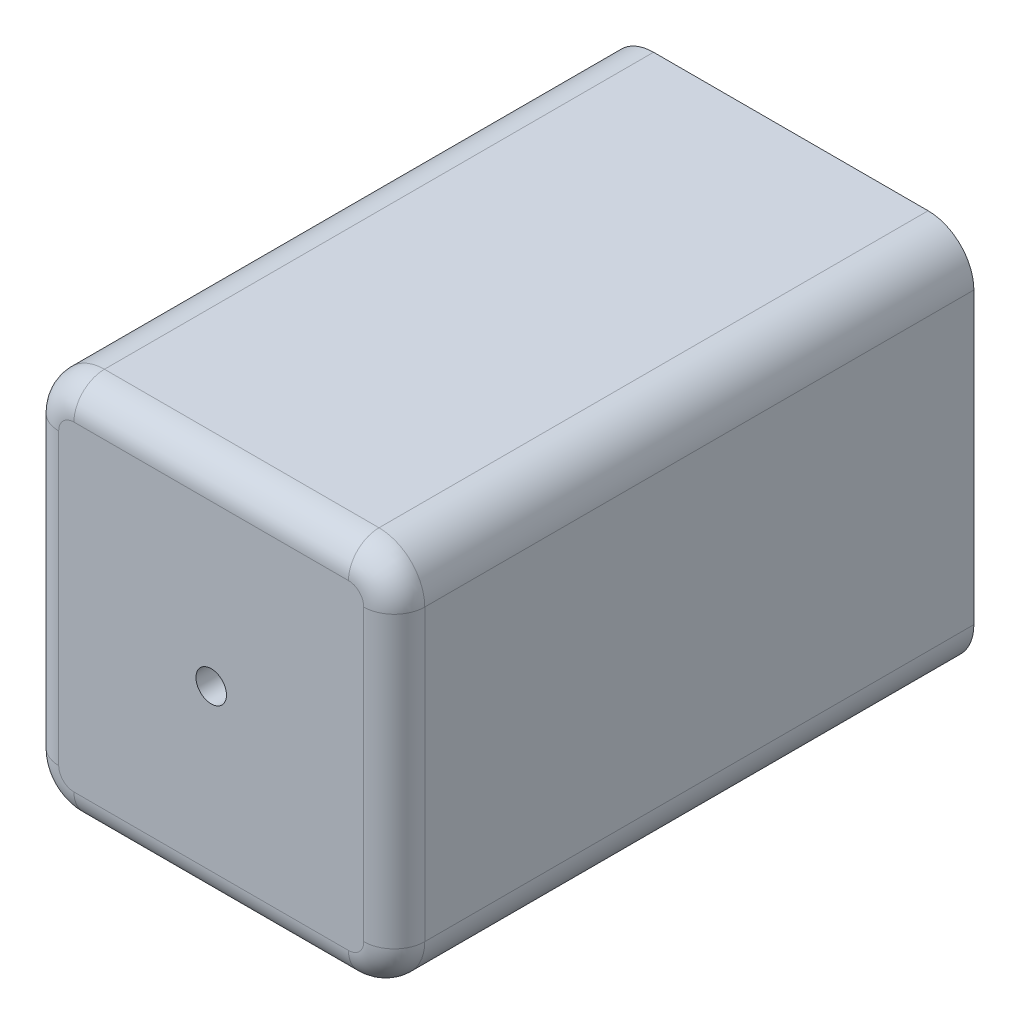
ISO-10303-21;
HEADER;
FILE_DESCRIPTION(('STEP AP214'),'2;1');
FILE_NAME('part.step','',(''),(''),'','','');
FILE_SCHEMA(('AUTOMOTIVE_DESIGN { 1 0 10303 214 1 1 1 1 }'));
ENDSEC;
DATA;
#1=APPLICATION_CONTEXT('core data for automotive mechanical design processes');
#2=APPLICATION_PROTOCOL_DEFINITION('international standard','automotive_design',2000,#1);
#3=PRODUCT_CONTEXT('',#1,'mechanical');
#4=PRODUCT('Part','Part','',(#3));
#5=PRODUCT_RELATED_PRODUCT_CATEGORY('part','',(#4));
#6=PRODUCT_DEFINITION_FORMATION('','',#4);
#7=PRODUCT_DEFINITION_CONTEXT('part definition',#1,'design');
#8=PRODUCT_DEFINITION('design','',#6,#7);
#9=PRODUCT_DEFINITION_SHAPE('','',#8);
#10=(LENGTH_UNIT() NAMED_UNIT(*) SI_UNIT(.MILLI.,.METRE.));
#11=(NAMED_UNIT(*) PLANE_ANGLE_UNIT() SI_UNIT($,.RADIAN.));
#12=(NAMED_UNIT(*) SI_UNIT($,.STERADIAN.) SOLID_ANGLE_UNIT());
#13=UNCERTAINTY_MEASURE_WITH_UNIT(LENGTH_MEASURE(1.E-05),#10,'distance_accuracy_value','');
#14=(GEOMETRIC_REPRESENTATION_CONTEXT(3) GLOBAL_UNCERTAINTY_ASSIGNED_CONTEXT((#13)) GLOBAL_UNIT_ASSIGNED_CONTEXT((#10,
#11,#12)) REPRESENTATION_CONTEXT('',''));
#15=CARTESIAN_POINT('',(0.,0.,0.));
#16=DIRECTION('',(0.,0.,1.));
#17=DIRECTION('',(1.,0.,0.));
#18=AXIS2_PLACEMENT_3D('',#15,#16,#17);
#19=CARTESIAN_POINT('',(120.,-62.5,-95.));
#20=DIRECTION('',(0.,0.,1.));
#21=DIRECTION('',(1.,0.,0.));
#22=AXIS2_PLACEMENT_3D('',#19,#20,#21);
#23=PLANE('',#22);
#24=CARTESIAN_POINT('',(60.,0.,-95.));
#25=DIRECTION('',(0.,0.,-1.));
#26=DIRECTION('',(-1.,0.,0.));
#27=AXIS2_PLACEMENT_3D('',#24,#25,#26);
#28=CIRCLE('',#27,5.);
#29=CARTESIAN_POINT('',(55.,0.,-95.));
#30=VERTEX_POINT('',#29);
#31=EDGE_CURVE('E154',#30,#30,#28,.T.);
#32=ORIENTED_EDGE('',*,*,#31,.F.);
#33=EDGE_LOOP('',(#32));
#34=FACE_BOUND('',#33,.T.);
#35=DIRECTION('',(-1.,0.,0.));
#36=VECTOR('',#35,1.);
#37=CARTESIAN_POINT('',(120.,62.5,-95.));
#38=LINE('',#37,#36);
#39=CARTESIAN_POINT('',(105.,62.5,-95.));
#40=VERTEX_POINT('',#39);
#41=CARTESIAN_POINT('',(15.,62.5,-95.));
#42=VERTEX_POINT('',#41);
#43=EDGE_CURVE('E134',#40,#42,#38,.T.);
#44=ORIENTED_EDGE('',*,*,#43,.F.);
#45=CARTESIAN_POINT('',(105.,47.5,-95.));
#46=DIRECTION('',(0.,0.,1.));
#47=DIRECTION('',(1.,0.,0.));
#48=AXIS2_PLACEMENT_3D('',#45,#46,#47);
#49=CIRCLE('',#48,15.);
#50=CARTESIAN_POINT('',(120.,47.5,-95.));
#51=VERTEX_POINT('',#50);
#52=EDGE_CURVE('E142',#40,#51,#49,.F.);
#53=ORIENTED_EDGE('',*,*,#52,.T.);
#54=DIRECTION('',(0.,1.,0.));
#55=VECTOR('',#54,1.);
#56=CARTESIAN_POINT('',(120.,-62.5,-95.));
#57=LINE('',#56,#55);
#58=CARTESIAN_POINT('',(120.,-47.5,-95.));
#59=VERTEX_POINT('',#58);
#60=EDGE_CURVE('E130',#59,#51,#57,.T.);
#61=ORIENTED_EDGE('',*,*,#60,.F.);
#62=CARTESIAN_POINT('',(105.,-47.5,-95.));
#63=DIRECTION('',(0.,0.,1.));
#64=DIRECTION('',(1.,0.,0.));
#65=AXIS2_PLACEMENT_3D('',#62,#63,#64);
#66=CIRCLE('',#65,15.);
#67=CARTESIAN_POINT('',(105.,-62.5,-95.));
#68=VERTEX_POINT('',#67);
#69=EDGE_CURVE('E136',#59,#68,#66,.F.);
#70=ORIENTED_EDGE('',*,*,#69,.T.);
#71=DIRECTION('',(-1.,0.,0.));
#72=VECTOR('',#71,1.);
#73=CARTESIAN_POINT('',(120.,-62.5,-95.));
#74=LINE('',#73,#72);
#75=CARTESIAN_POINT('',(15.,-62.5,-95.));
#76=VERTEX_POINT('',#75);
#77=EDGE_CURVE('E147',#68,#76,#74,.T.);
#78=ORIENTED_EDGE('',*,*,#77,.T.);
#79=CARTESIAN_POINT('',(15.,-47.5,-95.));
#80=DIRECTION('',(0.,0.,1.));
#81=DIRECTION('',(1.,0.,0.));
#82=AXIS2_PLACEMENT_3D('',#79,#80,#81);
#83=CIRCLE('',#82,15.);
#84=CARTESIAN_POINT('',(0.,-47.5,-95.));
#85=VERTEX_POINT('',#84);
#86=EDGE_CURVE('E165',#76,#85,#83,.F.);
#87=ORIENTED_EDGE('',*,*,#86,.T.);
#88=DIRECTION('',(0.,1.,0.));
#89=VECTOR('',#88,1.);
#90=CARTESIAN_POINT('',(0.,-62.5,-95.));
#91=LINE('',#90,#89);
#92=CARTESIAN_POINT('',(0.,47.5,-95.));
#93=VERTEX_POINT('',#92);
#94=EDGE_CURVE('E148',#85,#93,#91,.T.);
#95=ORIENTED_EDGE('',*,*,#94,.T.);
#96=CARTESIAN_POINT('',(15.,47.5,-95.));
#97=DIRECTION('',(0.,0.,1.));
#98=DIRECTION('',(1.,0.,0.));
#99=AXIS2_PLACEMENT_3D('',#96,#97,#98);
#100=CIRCLE('',#99,15.);
#101=EDGE_CURVE('E143',#93,#42,#100,.F.);
#102=ORIENTED_EDGE('',*,*,#101,.T.);
#103=EDGE_LOOP('',(#44,#53,#61,#70,#78,#87,#95,#102));
#104=FACE_BOUND('',#103,.T.);
#105=ADVANCED_FACE('F37',(#34,#104),#23,.F.);
#106=CARTESIAN_POINT('',(120.,62.5,95.));
#107=DIRECTION('',(0.,-1.,0.));
#108=DIRECTION('',(0.,0.,-1.));
#109=AXIS2_PLACEMENT_3D('',#106,#107,#108);
#110=PLANE('',#109);
#111=DIRECTION('',(0.,0.,1.));
#112=VECTOR('',#111,1.);
#113=CARTESIAN_POINT('',(15.,62.5,95.));
#114=LINE('',#113,#112);
#115=CARTESIAN_POINT('',(15.,62.5,85.));
#116=VERTEX_POINT('',#115);
#117=EDGE_CURVE('E160',#42,#116,#114,.T.);
#118=ORIENTED_EDGE('',*,*,#117,.T.);
#119=DIRECTION('',(-1.,0.,0.));
#120=VECTOR('',#119,1.);
#121=CARTESIAN_POINT('',(120.,62.5,85.));
#122=LINE('',#121,#120);
#123=CARTESIAN_POINT('',(105.,62.5,85.));
#124=VERTEX_POINT('',#123);
#125=EDGE_CURVE('E46',#116,#124,#122,.F.);
#126=ORIENTED_EDGE('',*,*,#125,.T.);
#127=DIRECTION('',(0.,0.,1.));
#128=VECTOR('',#127,1.);
#129=CARTESIAN_POINT('',(105.,62.5,95.));
#130=LINE('',#129,#128);
#131=EDGE_CURVE('E163',#124,#40,#130,.F.);
#132=ORIENTED_EDGE('',*,*,#131,.T.);
#133=ORIENTED_EDGE('',*,*,#43,.T.);
#134=EDGE_LOOP('',(#118,#126,#132,#133));
#135=FACE_BOUND('',#134,.T.);
#136=ADVANCED_FACE('F242',(#135),#110,.F.);
#137=CARTESIAN_POINT('',(120.,-62.5,95.));
#138=DIRECTION('',(0.,0.,-1.));
#139=DIRECTION('',(-1.,0.,0.));
#140=AXIS2_PLACEMENT_3D('',#137,#138,#139);
#141=PLANE('',#140);
#142=CARTESIAN_POINT('',(60.,0.,95.));
#143=DIRECTION('',(0.,0.,-1.));
#144=DIRECTION('',(-1.,0.,0.));
#145=AXIS2_PLACEMENT_3D('',#142,#143,#144);
#146=CIRCLE('',#145,5.);
#147=CARTESIAN_POINT('',(55.,0.,95.));
#148=VERTEX_POINT('',#147);
#149=EDGE_CURVE('E210',#148,#148,#146,.T.);
#150=ORIENTED_EDGE('',*,*,#149,.T.);
#151=EDGE_LOOP('',(#150));
#152=FACE_BOUND('',#151,.T.);
#153=CARTESIAN_POINT('',(15.,47.5,95.));
#154=DIRECTION('',(0.,0.,-1.));
#155=DIRECTION('',(-1.,0.,0.));
#156=AXIS2_PLACEMENT_3D('',#153,#154,#155);
#157=CIRCLE('',#156,5.);
#158=CARTESIAN_POINT('',(15.,52.5,95.));
#159=VERTEX_POINT('',#158);
#160=CARTESIAN_POINT('',(10.,47.5,95.));
#161=VERTEX_POINT('',#160);
#162=EDGE_CURVE('E187',#159,#161,#157,.F.);
#163=ORIENTED_EDGE('',*,*,#162,.T.);
#164=DIRECTION('',(0.,-1.,0.));
#165=VECTOR('',#164,1.);
#166=CARTESIAN_POINT('',(9.99999999999999,-47.5,95.));
#167=LINE('',#166,#165);
#168=CARTESIAN_POINT('',(10.,-47.5,95.));
#169=VERTEX_POINT('',#168);
#170=EDGE_CURVE('E192',#161,#169,#167,.T.);
#171=ORIENTED_EDGE('',*,*,#170,.T.);
#172=CARTESIAN_POINT('',(15.,-47.5,95.));
#173=DIRECTION('',(0.,0.,-1.));
#174=DIRECTION('',(-1.,0.,0.));
#175=AXIS2_PLACEMENT_3D('',#172,#173,#174);
#176=CIRCLE('',#175,5.);
#177=CARTESIAN_POINT('',(15.,-52.5,95.));
#178=VERTEX_POINT('',#177);
#179=EDGE_CURVE('E189',#169,#178,#176,.F.);
#180=ORIENTED_EDGE('',*,*,#179,.T.);
#181=DIRECTION('',(-1.,0.,0.));
#182=VECTOR('',#181,1.);
#183=CARTESIAN_POINT('',(120.,-52.5,95.));
#184=LINE('',#183,#182);
#185=CARTESIAN_POINT('',(105.,-52.5,95.));
#186=VERTEX_POINT('',#185);
#187=EDGE_CURVE('E185',#178,#186,#184,.F.);
#188=ORIENTED_EDGE('',*,*,#187,.T.);
#189=CARTESIAN_POINT('',(105.,-47.5,95.));
#190=DIRECTION('',(0.,0.,-1.));
#191=DIRECTION('',(-1.,0.,0.));
#192=AXIS2_PLACEMENT_3D('',#189,#190,#191);
#193=CIRCLE('',#192,5.);
#194=CARTESIAN_POINT('',(110.,-47.5,95.));
#195=VERTEX_POINT('',#194);
#196=EDGE_CURVE('E179',#186,#195,#193,.F.);
#197=ORIENTED_EDGE('',*,*,#196,.T.);
#198=DIRECTION('',(0.,-1.,0.));
#199=VECTOR('',#198,1.);
#200=CARTESIAN_POINT('',(110.,-62.5,95.));
#201=LINE('',#200,#199);
#202=CARTESIAN_POINT('',(110.,47.5,95.));
#203=VERTEX_POINT('',#202);
#204=EDGE_CURVE('E177',#195,#203,#201,.F.);
#205=ORIENTED_EDGE('',*,*,#204,.T.);
#206=CARTESIAN_POINT('',(105.,47.5,95.));
#207=DIRECTION('',(0.,0.,-1.));
#208=DIRECTION('',(-1.,0.,0.));
#209=AXIS2_PLACEMENT_3D('',#206,#207,#208);
#210=CIRCLE('',#209,5.);
#211=CARTESIAN_POINT('',(105.,52.5,95.));
#212=VERTEX_POINT('',#211);
#213=EDGE_CURVE('E181',#203,#212,#210,.F.);
#214=ORIENTED_EDGE('',*,*,#213,.T.);
#215=DIRECTION('',(-1.,0.,0.));
#216=VECTOR('',#215,1.);
#217=CARTESIAN_POINT('',(120.,52.5,95.));
#218=LINE('',#217,#216);
#219=EDGE_CURVE('E183',#212,#159,#218,.T.);
#220=ORIENTED_EDGE('',*,*,#219,.T.);
#221=EDGE_LOOP('',(#163,#171,#180,#188,#197,#205,#214,#220));
#222=FACE_BOUND('',#221,.T.);
#223=ADVANCED_FACE('F261',(#152,#222),#141,.F.);
#224=CARTESIAN_POINT('',(120.,-62.5,95.));
#225=DIRECTION('',(0.,1.,0.));
#226=DIRECTION('',(0.,0.,1.));
#227=AXIS2_PLACEMENT_3D('',#224,#225,#226);
#228=PLANE('',#227);
#229=DIRECTION('',(0.,0.,-1.));
#230=VECTOR('',#229,1.);
#231=CARTESIAN_POINT('',(105.,-62.5,95.));
#232=LINE('',#231,#230);
#233=CARTESIAN_POINT('',(105.,-62.5,85.));
#234=VERTEX_POINT('',#233);
#235=EDGE_CURVE('E138',#68,#234,#232,.F.);
#236=ORIENTED_EDGE('',*,*,#235,.T.);
#237=DIRECTION('',(-1.,0.,0.));
#238=VECTOR('',#237,1.);
#239=CARTESIAN_POINT('',(120.,-62.5,85.));
#240=LINE('',#239,#238);
#241=CARTESIAN_POINT('',(15.,-62.5,85.));
#242=VERTEX_POINT('',#241);
#243=EDGE_CURVE('E202',#234,#242,#240,.T.);
#244=ORIENTED_EDGE('',*,*,#243,.T.);
#245=DIRECTION('',(0.,0.,-1.));
#246=VECTOR('',#245,1.);
#247=CARTESIAN_POINT('',(15.,-62.5,-95.));
#248=LINE('',#247,#246);
#249=EDGE_CURVE('E169',#242,#76,#248,.T.);
#250=ORIENTED_EDGE('',*,*,#249,.T.);
#251=ORIENTED_EDGE('',*,*,#77,.F.);
#252=EDGE_LOOP('',(#236,#244,#250,#251));
#253=FACE_BOUND('',#252,.T.);
#254=ADVANCED_FACE('F274',(#253),#228,.F.);
#255=CARTESIAN_POINT('',(120.,0.,0.));
#256=DIRECTION('',(-1.,0.,0.));
#257=DIRECTION('',(0.,0.,1.));
#258=AXIS2_PLACEMENT_3D('',#255,#256,#257);
#259=PLANE('',#258);
#260=DIRECTION('',(0.,0.,1.));
#261=VECTOR('',#260,1.);
#262=CARTESIAN_POINT('',(120.,47.5,0.));
#263=LINE('',#262,#261);
#264=CARTESIAN_POINT('',(120.,47.5,85.));
#265=VERTEX_POINT('',#264);
#266=EDGE_CURVE('E133',#51,#265,#263,.T.);
#267=ORIENTED_EDGE('',*,*,#266,.T.);
#268=DIRECTION('',(0.,-1.,0.));
#269=VECTOR('',#268,1.);
#270=CARTESIAN_POINT('',(120.,0.,85.));
#271=LINE('',#270,#269);
#272=CARTESIAN_POINT('',(120.,-47.5,85.));
#273=VERTEX_POINT('',#272);
#274=EDGE_CURVE('E11',#265,#273,#271,.T.);
#275=ORIENTED_EDGE('',*,*,#274,.T.);
#276=DIRECTION('',(0.,0.,-1.));
#277=VECTOR('',#276,1.);
#278=CARTESIAN_POINT('',(120.,-47.5,0.));
#279=LINE('',#278,#277);
#280=EDGE_CURVE('E126',#273,#59,#279,.T.);
#281=ORIENTED_EDGE('',*,*,#280,.T.);
#282=ORIENTED_EDGE('',*,*,#60,.T.);
#283=EDGE_LOOP('',(#267,#275,#281,#282));
#284=FACE_BOUND('',#283,.T.);
#285=ADVANCED_FACE('F128',(#284),#259,.F.);
#286=CARTESIAN_POINT('',(0.,0.,0.));
#287=DIRECTION('',(-1.,0.,0.));
#288=DIRECTION('',(0.,0.,1.));
#289=AXIS2_PLACEMENT_3D('',#286,#287,#288);
#290=PLANE('',#289);
#291=DIRECTION('',(0.,0.,-1.));
#292=VECTOR('',#291,1.);
#293=CARTESIAN_POINT('',(0.,-47.5,95.));
#294=LINE('',#293,#292);
#295=CARTESIAN_POINT('',(0.,-47.5,85.));
#296=VERTEX_POINT('',#295);
#297=EDGE_CURVE('E172',#85,#296,#294,.F.);
#298=ORIENTED_EDGE('',*,*,#297,.T.);
#299=DIRECTION('',(0.,-1.,0.));
#300=VECTOR('',#299,1.);
#301=CARTESIAN_POINT('',(0.,47.5,85.));
#302=LINE('',#301,#300);
#303=CARTESIAN_POINT('',(0.,47.5,85.));
#304=VERTEX_POINT('',#303);
#305=EDGE_CURVE('E204',#296,#304,#302,.F.);
#306=ORIENTED_EDGE('',*,*,#305,.T.);
#307=DIRECTION('',(0.,0.,1.));
#308=VECTOR('',#307,1.);
#309=CARTESIAN_POINT('',(0.,47.5,-95.));
#310=LINE('',#309,#308);
#311=EDGE_CURVE('E175',#304,#93,#310,.F.);
#312=ORIENTED_EDGE('',*,*,#311,.T.);
#313=ORIENTED_EDGE('',*,*,#94,.F.);
#314=EDGE_LOOP('',(#298,#306,#312,#313));
#315=FACE_BOUND('',#314,.T.);
#316=ADVANCED_FACE('F305',(#315),#290,.T.);
#317=CARTESIAN_POINT('',(105.,47.5,0.));
#318=DIRECTION('',(0.,0.,1.));
#319=DIRECTION('',(1.,0.,0.));
#320=AXIS2_PLACEMENT_3D('',#317,#318,#319);
#321=CYLINDRICAL_SURFACE('',#320,15.);
#322=ORIENTED_EDGE('',*,*,#131,.F.);
#323=CARTESIAN_POINT('',(105.,47.5,85.));
#324=DIRECTION('',(0.,0.,-1.));
#325=DIRECTION('',(-1.,0.,0.));
#326=AXIS2_PLACEMENT_3D('',#323,#324,#325);
#327=CIRCLE('',#326,15.);
#328=EDGE_CURVE('E199',#124,#265,#327,.T.);
#329=ORIENTED_EDGE('',*,*,#328,.T.);
#330=ORIENTED_EDGE('',*,*,#266,.F.);
#331=ORIENTED_EDGE('',*,*,#52,.F.);
#332=EDGE_LOOP('',(#322,#329,#330,#331));
#333=FACE_BOUND('',#332,.T.);
#334=ADVANCED_FACE('F240',(#333),#321,.T.);
#335=CARTESIAN_POINT('',(105.,-47.5,0.));
#336=DIRECTION('',(0.,0.,-1.));
#337=DIRECTION('',(-1.,0.,0.));
#338=AXIS2_PLACEMENT_3D('',#335,#336,#337);
#339=CYLINDRICAL_SURFACE('',#338,15.);
#340=ORIENTED_EDGE('',*,*,#280,.F.);
#341=CARTESIAN_POINT('',(105.,-47.5,85.));
#342=DIRECTION('',(0.,0.,-1.));
#343=DIRECTION('',(-1.,0.,0.));
#344=AXIS2_PLACEMENT_3D('',#341,#342,#343);
#345=CIRCLE('',#344,15.);
#346=EDGE_CURVE('E59',#273,#234,#345,.T.);
#347=ORIENTED_EDGE('',*,*,#346,.T.);
#348=ORIENTED_EDGE('',*,*,#235,.F.);
#349=ORIENTED_EDGE('',*,*,#69,.F.);
#350=EDGE_LOOP('',(#340,#347,#348,#349));
#351=FACE_BOUND('',#350,.T.);
#352=ADVANCED_FACE('F137',(#351),#339,.T.);
#353=CARTESIAN_POINT('',(15.,47.5,95.));
#354=DIRECTION('',(0.,0.,-1.));
#355=DIRECTION('',(-1.,0.,0.));
#356=AXIS2_PLACEMENT_3D('',#353,#354,#355);
#357=CYLINDRICAL_SURFACE('',#356,15.);
#358=ORIENTED_EDGE('',*,*,#311,.F.);
#359=CARTESIAN_POINT('',(15.,47.5,85.));
#360=DIRECTION('',(0.,0.,-1.));
#361=DIRECTION('',(-1.,0.,0.));
#362=AXIS2_PLACEMENT_3D('',#359,#360,#361);
#363=CIRCLE('',#362,15.);
#364=EDGE_CURVE('E197',#304,#116,#363,.T.);
#365=ORIENTED_EDGE('',*,*,#364,.T.);
#366=ORIENTED_EDGE('',*,*,#117,.F.);
#367=ORIENTED_EDGE('',*,*,#101,.F.);
#368=EDGE_LOOP('',(#358,#365,#366,#367));
#369=FACE_BOUND('',#368,.T.);
#370=ADVANCED_FACE('F248',(#369),#357,.T.);
#371=CARTESIAN_POINT('',(15.,-47.5,95.));
#372=DIRECTION('',(0.,0.,1.));
#373=DIRECTION('',(1.,0.,0.));
#374=AXIS2_PLACEMENT_3D('',#371,#372,#373);
#375=CYLINDRICAL_SURFACE('',#374,15.);
#376=ORIENTED_EDGE('',*,*,#249,.F.);
#377=CARTESIAN_POINT('',(15.,-47.5,85.));
#378=DIRECTION('',(0.,0.,-1.));
#379=DIRECTION('',(-1.,0.,0.));
#380=AXIS2_PLACEMENT_3D('',#377,#378,#379);
#381=CIRCLE('',#380,15.);
#382=EDGE_CURVE('E194',#242,#296,#381,.T.);
#383=ORIENTED_EDGE('',*,*,#382,.T.);
#384=ORIENTED_EDGE('',*,*,#297,.F.);
#385=ORIENTED_EDGE('',*,*,#86,.F.);
#386=EDGE_LOOP('',(#376,#383,#384,#385));
#387=FACE_BOUND('',#386,.T.);
#388=ADVANCED_FACE('F278',(#387),#375,.T.);
#389=CARTESIAN_POINT('',(105.,47.5,85.));
#390=DIRECTION('',(0.,0.,-1.));
#391=DIRECTION('',(-1.,0.,0.));
#392=AXIS2_PLACEMENT_3D('',#389,#390,#391);
#393=DEGENERATE_TOROIDAL_SURFACE('',#392,5.,10.,.T.);
#394=CARTESIAN_POINT('',(110.,47.5,85.));
#395=DIRECTION('',(0.,-1.,0.));
#396=DIRECTION('',(0.,0.,-1.));
#397=AXIS2_PLACEMENT_3D('',#394,#395,#396);
#398=CIRCLE('',#397,10.);
#399=EDGE_CURVE('E223',#265,#203,#398,.T.);
#400=ORIENTED_EDGE('',*,*,#399,.F.);
#401=ORIENTED_EDGE('',*,*,#328,.F.);
#402=CARTESIAN_POINT('',(105.,52.5,85.));
#403=DIRECTION('',(-1.,0.,0.));
#404=DIRECTION('',(0.,0.,1.));
#405=AXIS2_PLACEMENT_3D('',#402,#403,#404);
#406=CIRCLE('',#405,10.);
#407=EDGE_CURVE('E41',#212,#124,#406,.T.);
#408=ORIENTED_EDGE('',*,*,#407,.F.);
#409=ORIENTED_EDGE('',*,*,#213,.F.);
#410=EDGE_LOOP('',(#400,#401,#408,#409));
#411=FACE_BOUND('',#410,.T.);
#412=ADVANCED_FACE('F39',(#411),#393,.T.);
#413=CARTESIAN_POINT('',(120.,52.5,85.));
#414=DIRECTION('',(-1.,0.,0.));
#415=DIRECTION('',(0.,0.,1.));
#416=AXIS2_PLACEMENT_3D('',#413,#414,#415);
#417=CYLINDRICAL_SURFACE('',#416,10.);
#418=ORIENTED_EDGE('',*,*,#407,.T.);
#419=ORIENTED_EDGE('',*,*,#125,.F.);
#420=CARTESIAN_POINT('',(15.,52.5,85.));
#421=DIRECTION('',(-1.,0.,0.));
#422=DIRECTION('',(0.,0.,1.));
#423=AXIS2_PLACEMENT_3D('',#420,#421,#422);
#424=CIRCLE('',#423,10.);
#425=EDGE_CURVE('E221',#159,#116,#424,.T.);
#426=ORIENTED_EDGE('',*,*,#425,.F.);
#427=ORIENTED_EDGE('',*,*,#219,.F.);
#428=EDGE_LOOP('',(#418,#419,#426,#427));
#429=FACE_BOUND('',#428,.T.);
#430=ADVANCED_FACE('F233',(#429),#417,.T.);
#431=CARTESIAN_POINT('',(110.,0.,85.));
#432=DIRECTION('',(0.,-1.,0.));
#433=DIRECTION('',(0.,0.,-1.));
#434=AXIS2_PLACEMENT_3D('',#431,#432,#433);
#435=CYLINDRICAL_SURFACE('',#434,10.);
#436=ORIENTED_EDGE('',*,*,#399,.T.);
#437=ORIENTED_EDGE('',*,*,#204,.F.);
#438=CARTESIAN_POINT('',(110.,-47.5,85.));
#439=DIRECTION('',(0.,-1.,0.));
#440=DIRECTION('',(0.,0.,-1.));
#441=AXIS2_PLACEMENT_3D('',#438,#439,#440);
#442=CIRCLE('',#441,10.);
#443=EDGE_CURVE('E218',#273,#195,#442,.T.);
#444=ORIENTED_EDGE('',*,*,#443,.F.);
#445=ORIENTED_EDGE('',*,*,#274,.F.);
#446=EDGE_LOOP('',(#436,#437,#444,#445));
#447=FACE_BOUND('',#446,.T.);
#448=ADVANCED_FACE('F263',(#447),#435,.T.);
#449=CARTESIAN_POINT('',(15.,47.5,85.));
#450=DIRECTION('',(0.,0.,-1.));
#451=DIRECTION('',(-1.,0.,0.));
#452=AXIS2_PLACEMENT_3D('',#449,#450,#451);
#453=DEGENERATE_TOROIDAL_SURFACE('',#452,5.,10.,.T.);
#454=ORIENTED_EDGE('',*,*,#425,.T.);
#455=ORIENTED_EDGE('',*,*,#364,.F.);
#456=CARTESIAN_POINT('',(10.,47.5,85.));
#457=DIRECTION('',(0.,-1.,0.));
#458=DIRECTION('',(0.,0.,-1.));
#459=AXIS2_PLACEMENT_3D('',#456,#457,#458);
#460=CIRCLE('',#459,10.);
#461=EDGE_CURVE('E215',#161,#304,#460,.T.);
#462=ORIENTED_EDGE('',*,*,#461,.F.);
#463=ORIENTED_EDGE('',*,*,#162,.F.);
#464=EDGE_LOOP('',(#454,#455,#462,#463));
#465=FACE_BOUND('',#464,.T.);
#466=ADVANCED_FACE('F252',(#465),#453,.T.);
#467=CARTESIAN_POINT('',(105.,-47.5,85.));
#468=DIRECTION('',(0.,0.,-1.));
#469=DIRECTION('',(-1.,0.,0.));
#470=AXIS2_PLACEMENT_3D('',#467,#468,#469);
#471=DEGENERATE_TOROIDAL_SURFACE('',#470,5.,10.,.T.);
#472=ORIENTED_EDGE('',*,*,#443,.T.);
#473=ORIENTED_EDGE('',*,*,#196,.F.);
#474=CARTESIAN_POINT('',(105.,-52.5,85.));
#475=DIRECTION('',(-1.,0.,0.));
#476=DIRECTION('',(0.,0.,1.));
#477=AXIS2_PLACEMENT_3D('',#474,#475,#476);
#478=CIRCLE('',#477,10.);
#479=EDGE_CURVE('E212',#234,#186,#478,.T.);
#480=ORIENTED_EDGE('',*,*,#479,.F.);
#481=ORIENTED_EDGE('',*,*,#346,.F.);
#482=EDGE_LOOP('',(#472,#473,#480,#481));
#483=FACE_BOUND('',#482,.T.);
#484=ADVANCED_FACE('F265',(#483),#471,.T.);
#485=CARTESIAN_POINT('',(9.99999999999999,-62.5,85.));
#486=DIRECTION('',(0.,1.,0.));
#487=DIRECTION('',(0.,0.,1.));
#488=AXIS2_PLACEMENT_3D('',#485,#486,#487);
#489=CYLINDRICAL_SURFACE('',#488,10.);
#490=ORIENTED_EDGE('',*,*,#461,.T.);
#491=ORIENTED_EDGE('',*,*,#305,.F.);
#492=CARTESIAN_POINT('',(9.99999999999999,-47.5,85.));
#493=DIRECTION('',(0.,-1.,0.));
#494=DIRECTION('',(0.,0.,-1.));
#495=AXIS2_PLACEMENT_3D('',#492,#493,#494);
#496=CIRCLE('',#495,10.);
#497=EDGE_CURVE('E209',#169,#296,#496,.T.);
#498=ORIENTED_EDGE('',*,*,#497,.F.);
#499=ORIENTED_EDGE('',*,*,#170,.F.);
#500=EDGE_LOOP('',(#490,#491,#498,#499));
#501=FACE_BOUND('',#500,.T.);
#502=ADVANCED_FACE('F257',(#501),#489,.T.);
#503=CARTESIAN_POINT('',(120.,-52.5,85.));
#504=DIRECTION('',(-1.,0.,0.));
#505=DIRECTION('',(0.,0.,1.));
#506=AXIS2_PLACEMENT_3D('',#503,#504,#505);
#507=CYLINDRICAL_SURFACE('',#506,10.);
#508=ORIENTED_EDGE('',*,*,#479,.T.);
#509=ORIENTED_EDGE('',*,*,#187,.F.);
#510=CARTESIAN_POINT('',(15.,-52.5,85.));
#511=DIRECTION('',(-1.,0.,0.));
#512=DIRECTION('',(0.,0.,1.));
#513=AXIS2_PLACEMENT_3D('',#510,#511,#512);
#514=CIRCLE('',#513,10.);
#515=EDGE_CURVE('E207',#242,#178,#514,.T.);
#516=ORIENTED_EDGE('',*,*,#515,.F.);
#517=ORIENTED_EDGE('',*,*,#243,.F.);
#518=EDGE_LOOP('',(#508,#509,#516,#517));
#519=FACE_BOUND('',#518,.T.);
#520=ADVANCED_FACE('F271',(#519),#507,.T.);
#521=CARTESIAN_POINT('',(15.,-47.5,85.));
#522=DIRECTION('',(0.,0.,-1.));
#523=DIRECTION('',(-1.,0.,0.));
#524=AXIS2_PLACEMENT_3D('',#521,#522,#523);
#525=DEGENERATE_TOROIDAL_SURFACE('',#524,5.,10.,.T.);
#526=ORIENTED_EDGE('',*,*,#497,.T.);
#527=ORIENTED_EDGE('',*,*,#382,.F.);
#528=ORIENTED_EDGE('',*,*,#515,.T.);
#529=ORIENTED_EDGE('',*,*,#179,.F.);
#530=EDGE_LOOP('',(#526,#527,#528,#529));
#531=FACE_BOUND('',#530,.T.);
#532=ADVANCED_FACE('F281',(#531),#525,.T.);
#533=CARTESIAN_POINT('',(60.,0.,95.));
#534=DIRECTION('',(0.,0.,-1.));
#535=DIRECTION('',(-1.,0.,0.));
#536=AXIS2_PLACEMENT_3D('',#533,#534,#535);
#537=CYLINDRICAL_SURFACE('',#536,5.);
#538=ORIENTED_EDGE('',*,*,#149,.F.);
#539=EDGE_LOOP('',(#538));
#540=FACE_BOUND('',#539,.T.);
#541=ORIENTED_EDGE('',*,*,#31,.T.);
#542=EDGE_LOOP('',(#541));
#543=FACE_BOUND('',#542,.T.);
#544=ADVANCED_FACE('F283',(#540,#543),#537,.F.);
#545=CLOSED_SHELL('',(#105,#136,#223,#254,#285,#316,#334,#352,#370,#388,#412,#430,#448,#466,
#484,#502,#520,#532,#544));
#546=MANIFOLD_SOLID_BREP('B2',#545);
#547=ADVANCED_BREP_SHAPE_REPRESENTATION('',(#18,#546),#14);
#548=SHAPE_DEFINITION_REPRESENTATION(#9,#547);
ENDSEC;
END-ISO-10303-21;
